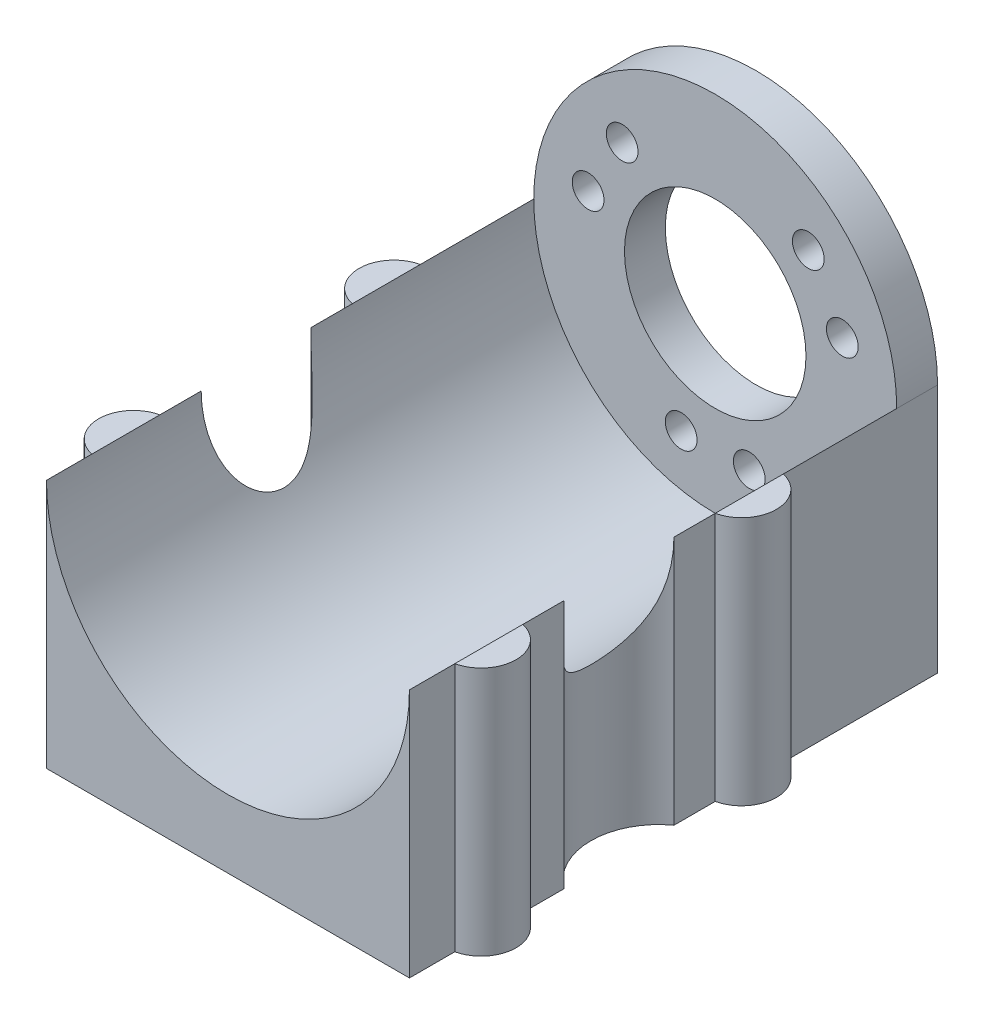
ISO-10303-21;
HEADER;
FILE_DESCRIPTION(('STEP AP214'),'2;1');
FILE_NAME('part.step','',(''),(''),'','','');
FILE_SCHEMA(('AUTOMOTIVE_DESIGN { 1 0 10303 214 1 1 1 1 }'));
ENDSEC;
DATA;
#1=APPLICATION_CONTEXT('core data for automotive mechanical design processes');
#2=APPLICATION_PROTOCOL_DEFINITION('international standard','automotive_design',2000,#1);
#3=PRODUCT_CONTEXT('',#1,'mechanical');
#4=PRODUCT('Part','Part','',(#3));
#5=PRODUCT_RELATED_PRODUCT_CATEGORY('part','',(#4));
#6=PRODUCT_DEFINITION_FORMATION('','',#4);
#7=PRODUCT_DEFINITION_CONTEXT('part definition',#1,'design');
#8=PRODUCT_DEFINITION('design','',#6,#7);
#9=PRODUCT_DEFINITION_SHAPE('','',#8);
#10=(LENGTH_UNIT() NAMED_UNIT(*) SI_UNIT(.MILLI.,.METRE.));
#11=(NAMED_UNIT(*) PLANE_ANGLE_UNIT() SI_UNIT($,.RADIAN.));
#12=(NAMED_UNIT(*) SI_UNIT($,.STERADIAN.) SOLID_ANGLE_UNIT());
#13=UNCERTAINTY_MEASURE_WITH_UNIT(LENGTH_MEASURE(1.E-05),#10,'distance_accuracy_value','');
#14=(GEOMETRIC_REPRESENTATION_CONTEXT(3) GLOBAL_UNCERTAINTY_ASSIGNED_CONTEXT((#13)) GLOBAL_UNIT_ASSIGNED_CONTEXT((#10,
#11,#12)) REPRESENTATION_CONTEXT('',''));
#15=CARTESIAN_POINT('',(0.,0.,0.));
#16=DIRECTION('',(0.,0.,1.));
#17=DIRECTION('',(1.,0.,0.));
#18=AXIS2_PLACEMENT_3D('',#15,#16,#17);
#19=CARTESIAN_POINT('',(0.,27.5,0.));
#20=DIRECTION('',(0.,-1.,0.));
#21=DIRECTION('',(0.,0.,-1.));
#22=AXIS2_PLACEMENT_3D('',#19,#20,#21);
#23=PLANE('',#22);
#24=CARTESIAN_POINT('',(0.84375067405984,27.5,-8.75));
#25=DIRECTION('',(0.,1.,0.));
#26=DIRECTION('',(0.,0.,-1.));
#27=AXIS2_PLACEMENT_3D('',#24,#25,#26);
#28=CIRCLE('',#27,3.84375014796441);
#29=CARTESIAN_POINT('',(0.,27.5,-12.5));
#30=VERTEX_POINT('',#29);
#31=CARTESIAN_POINT('',(0.,27.5,-5.));
#32=VERTEX_POINT('',#31);
#33=EDGE_CURVE('E286',#30,#32,#28,.T.);
#34=ORIENTED_EDGE('',*,*,#33,.T.);
#35=DIRECTION('',(0.,0.,-1.));
#36=VECTOR('',#35,1.);
#37=CARTESIAN_POINT('',(0.,27.5,0.));
#38=LINE('',#37,#36);
#39=EDGE_CURVE('E194',#32,#30,#38,.T.);
#40=ORIENTED_EDGE('',*,*,#39,.T.);
#41=EDGE_LOOP('',(#34,#40));
#42=FACE_BOUND('',#41,.T.);
#43=ADVANCED_FACE('F32',(#42),#23,.F.);
#44=CARTESIAN_POINT('',(0.843750674059841,27.5,-37.45));
#45=DIRECTION('',(0.,1.,0.));
#46=DIRECTION('',(0.,0.,-1.));
#47=AXIS2_PLACEMENT_3D('',#44,#45,#46);
#48=CIRCLE('',#47,3.84375014796441);
#49=CARTESIAN_POINT('',(0.,27.5,-41.2));
#50=VERTEX_POINT('',#49);
#51=CARTESIAN_POINT('',(0.,27.5,-33.7));
#52=VERTEX_POINT('',#51);
#53=EDGE_CURVE('E350',#50,#52,#48,.T.);
#54=ORIENTED_EDGE('',*,*,#53,.T.);
#55=EDGE_CURVE('E196',#52,#50,#38,.T.);
#56=ORIENTED_EDGE('',*,*,#55,.T.);
#57=EDGE_LOOP('',(#54,#56));
#58=FACE_BOUND('',#57,.T.);
#59=ADVANCED_FACE('F230',(#58),#23,.F.);
#60=CARTESIAN_POINT('',(39.1562493259402,27.5,-37.45));
#61=DIRECTION('',(0.,1.,0.));
#62=DIRECTION('',(0.,0.,1.));
#63=AXIS2_PLACEMENT_3D('',#60,#61,#62);
#64=CIRCLE('',#63,3.84375014796441);
#65=CARTESIAN_POINT('',(40.,27.5,-33.7));
#66=VERTEX_POINT('',#65);
#67=CARTESIAN_POINT('',(40.,27.5,-41.2));
#68=VERTEX_POINT('',#67);
#69=EDGE_CURVE('E268',#66,#68,#64,.T.);
#70=ORIENTED_EDGE('',*,*,#69,.T.);
#71=DIRECTION('',(0.,0.,-1.));
#72=VECTOR('',#71,1.);
#73=CARTESIAN_POINT('',(40.,27.5,0.));
#74=LINE('',#73,#72);
#75=EDGE_CURVE('E208',#68,#66,#74,.F.);
#76=ORIENTED_EDGE('',*,*,#75,.T.);
#77=EDGE_LOOP('',(#70,#76));
#78=FACE_BOUND('',#77,.T.);
#79=ADVANCED_FACE('F237',(#78),#23,.F.);
#80=CARTESIAN_POINT('',(40.,27.5,-53.7));
#81=DIRECTION('',(-1.,0.,0.));
#82=DIRECTION('',(0.,0.,1.));
#83=AXIS2_PLACEMENT_3D('',#80,#81,#82);
#84=PLANE('',#83);
#85=DIRECTION('',(0.,0.,-1.));
#86=VECTOR('',#85,1.);
#87=CARTESIAN_POINT('',(40.,0.,-53.7));
#88=LINE('',#87,#86);
#89=CARTESIAN_POINT('',(40.,0.,-12.5));
#90=VERTEX_POINT('',#89);
#91=CARTESIAN_POINT('',(40.,0.,-17.05));
#92=VERTEX_POINT('',#91);
#93=EDGE_CURVE('E315',#90,#92,#88,.T.);
#94=ORIENTED_EDGE('',*,*,#93,.T.);
#95=DIRECTION('',(0.,1.,0.));
#96=VECTOR('',#95,1.);
#97=CARTESIAN_POINT('',(40.,0.,-17.05));
#98=LINE('',#97,#96);
#99=CARTESIAN_POINT('',(40.,27.5,-17.05));
#100=VERTEX_POINT('',#99);
#101=EDGE_CURVE('E53',#92,#100,#98,.T.);
#102=ORIENTED_EDGE('',*,*,#101,.T.);
#103=DIRECTION('',(0.,0.,-1.));
#104=VECTOR('',#103,1.);
#105=CARTESIAN_POINT('',(40.,27.5,-53.7));
#106=LINE('',#105,#104);
#107=CARTESIAN_POINT('',(40.,27.5,-12.5));
#108=VERTEX_POINT('',#107);
#109=EDGE_CURVE('E302',#108,#100,#106,.T.);
#110=ORIENTED_EDGE('',*,*,#109,.F.);
#111=DIRECTION('',(0.,1.,0.));
#112=VECTOR('',#111,1.);
#113=CARTESIAN_POINT('',(40.,0.,-12.5));
#114=LINE('',#113,#112);
#115=EDGE_CURVE('E340',#90,#108,#114,.T.);
#116=ORIENTED_EDGE('',*,*,#115,.F.);
#117=EDGE_LOOP('',(#94,#102,#110,#116));
#118=FACE_BOUND('',#117,.T.);
#119=ADVANCED_FACE('F258',(#118),#84,.F.);
#120=CARTESIAN_POINT('',(0.,27.5,0.));
#121=DIRECTION('',(1.,0.,0.));
#122=DIRECTION('',(0.,0.,-1.));
#123=AXIS2_PLACEMENT_3D('',#120,#121,#122);
#124=PLANE('',#123);
#125=DIRECTION('',(0.,0.,1.));
#126=VECTOR('',#125,1.);
#127=CARTESIAN_POINT('',(0.,0.,0.));
#128=LINE('',#127,#126);
#129=CARTESIAN_POINT('',(0.,0.,-33.7));
#130=VERTEX_POINT('',#129);
#131=CARTESIAN_POINT('',(0.,0.,-29.15));
#132=VERTEX_POINT('',#131);
#133=EDGE_CURVE('E319',#130,#132,#128,.T.);
#134=ORIENTED_EDGE('',*,*,#133,.T.);
#135=DIRECTION('',(0.,1.,0.));
#136=VECTOR('',#135,1.);
#137=CARTESIAN_POINT('',(0.,0.,-29.15));
#138=LINE('',#137,#136);
#139=CARTESIAN_POINT('',(0.,27.5,-29.15));
#140=VERTEX_POINT('',#139);
#141=EDGE_CURVE('E60',#132,#140,#138,.T.);
#142=ORIENTED_EDGE('',*,*,#141,.T.);
#143=DIRECTION('',(0.,0.,1.));
#144=VECTOR('',#143,1.);
#145=CARTESIAN_POINT('',(0.,27.5,0.));
#146=LINE('',#145,#144);
#147=EDGE_CURVE('E308',#52,#140,#146,.T.);
#148=ORIENTED_EDGE('',*,*,#147,.F.);
#149=DIRECTION('',(0.,1.,0.));
#150=VECTOR('',#149,1.);
#151=CARTESIAN_POINT('',(0.,0.,-33.7));
#152=LINE('',#151,#150);
#153=EDGE_CURVE('E280',#130,#52,#152,.T.);
#154=ORIENTED_EDGE('',*,*,#153,.F.);
#155=EDGE_LOOP('',(#134,#142,#148,#154));
#156=FACE_BOUND('',#155,.T.);
#157=ADVANCED_FACE('F254',(#156),#124,.F.);
#158=CARTESIAN_POINT('',(40.,0.,0.));
#159=VERTEX_POINT('',#158);
#160=CARTESIAN_POINT('',(40.,0.,-5.00000000000001));
#161=VERTEX_POINT('',#160);
#162=EDGE_CURVE('E312',#159,#161,#88,.T.);
#163=ORIENTED_EDGE('',*,*,#162,.T.);
#164=DIRECTION('',(0.,1.,0.));
#165=VECTOR('',#164,1.);
#166=CARTESIAN_POINT('',(40.,0.,-5.));
#167=LINE('',#166,#165);
#168=CARTESIAN_POINT('',(40.,27.5,-5.));
#169=VERTEX_POINT('',#168);
#170=EDGE_CURVE('E343',#161,#169,#167,.T.);
#171=ORIENTED_EDGE('',*,*,#170,.T.);
#172=CARTESIAN_POINT('',(40.,27.5,0.));
#173=VERTEX_POINT('',#172);
#174=EDGE_CURVE('E299',#173,#169,#106,.T.);
#175=ORIENTED_EDGE('',*,*,#174,.F.);
#176=DIRECTION('',(0.,-1.,0.));
#177=VECTOR('',#176,1.);
#178=CARTESIAN_POINT('',(40.,27.5,0.));
#179=LINE('',#178,#177);
#180=EDGE_CURVE('E46',#173,#159,#179,.T.);
#181=ORIENTED_EDGE('',*,*,#180,.T.);
#182=EDGE_LOOP('',(#163,#171,#175,#181));
#183=FACE_BOUND('',#182,.T.);
#184=ADVANCED_FACE('F264',(#183),#84,.F.);
#185=CARTESIAN_POINT('',(0.,0.,-58.2));
#186=VERTEX_POINT('',#185);
#187=CARTESIAN_POINT('',(0.,0.,-41.2));
#188=VERTEX_POINT('',#187);
#189=EDGE_CURVE('E317',#186,#188,#128,.T.);
#190=ORIENTED_EDGE('',*,*,#189,.T.);
#191=DIRECTION('',(0.,1.,0.));
#192=VECTOR('',#191,1.);
#193=CARTESIAN_POINT('',(0.,0.,-41.2));
#194=LINE('',#193,#192);
#195=EDGE_CURVE('E274',#188,#50,#194,.T.);
#196=ORIENTED_EDGE('',*,*,#195,.T.);
#197=CARTESIAN_POINT('',(0.,27.5,-53.7));
#198=VERTEX_POINT('',#197);
#199=EDGE_CURVE('E305',#198,#50,#146,.T.);
#200=ORIENTED_EDGE('',*,*,#199,.F.);
#201=DIRECTION('',(0.,0.,1.));
#202=VECTOR('',#201,1.);
#203=CARTESIAN_POINT('',(0.,27.5,-58.2));
#204=LINE('',#203,#202);
#205=CARTESIAN_POINT('',(0.,27.5,-58.2));
#206=VERTEX_POINT('',#205);
#207=EDGE_CURVE('E185',#206,#198,#204,.T.);
#208=ORIENTED_EDGE('',*,*,#207,.F.);
#209=DIRECTION('',(0.,1.,0.));
#210=VECTOR('',#209,1.);
#211=CARTESIAN_POINT('',(0.,0.,-58.2));
#212=LINE('',#211,#210);
#213=EDGE_CURVE('E176',#186,#206,#212,.T.);
#214=ORIENTED_EDGE('',*,*,#213,.F.);
#215=EDGE_LOOP('',(#190,#196,#200,#208,#214));
#216=FACE_BOUND('',#215,.T.);
#217=ADVANCED_FACE('F368',(#216),#124,.F.);
#218=CARTESIAN_POINT('',(40.,27.5,-29.15));
#219=VERTEX_POINT('',#218);
#220=EDGE_CURVE('E303',#219,#66,#106,.T.);
#221=ORIENTED_EDGE('',*,*,#220,.F.);
#222=DIRECTION('',(0.,1.,0.));
#223=VECTOR('',#222,1.);
#224=CARTESIAN_POINT('',(40.,0.,-29.15));
#225=LINE('',#224,#223);
#226=CARTESIAN_POINT('',(40.,0.,-29.15));
#227=VERTEX_POINT('',#226);
#228=EDGE_CURVE('E381',#227,#219,#225,.T.);
#229=ORIENTED_EDGE('',*,*,#228,.F.);
#230=CARTESIAN_POINT('',(40.,0.,-33.7));
#231=VERTEX_POINT('',#230);
#232=EDGE_CURVE('E316',#227,#231,#88,.T.);
#233=ORIENTED_EDGE('',*,*,#232,.T.);
#234=DIRECTION('',(0.,1.,0.));
#235=VECTOR('',#234,1.);
#236=CARTESIAN_POINT('',(40.,0.,-33.7));
#237=LINE('',#236,#235);
#238=EDGE_CURVE('E284',#231,#66,#237,.T.);
#239=ORIENTED_EDGE('',*,*,#238,.T.);
#240=EDGE_LOOP('',(#221,#229,#233,#239));
#241=FACE_BOUND('',#240,.T.);
#242=ADVANCED_FACE('F388',(#241),#84,.F.);
#243=CARTESIAN_POINT('',(0.,27.5,-17.05));
#244=VERTEX_POINT('',#243);
#245=EDGE_CURVE('E309',#244,#30,#146,.T.);
#246=ORIENTED_EDGE('',*,*,#245,.F.);
#247=DIRECTION('',(0.,1.,0.));
#248=VECTOR('',#247,1.);
#249=CARTESIAN_POINT('',(0.,0.,-17.05));
#250=LINE('',#249,#248);
#251=CARTESIAN_POINT('',(0.,0.,-17.05));
#252=VERTEX_POINT('',#251);
#253=EDGE_CURVE('E345',#252,#244,#250,.T.);
#254=ORIENTED_EDGE('',*,*,#253,.F.);
#255=CARTESIAN_POINT('',(0.,0.,-12.5));
#256=VERTEX_POINT('',#255);
#257=EDGE_CURVE('E320',#252,#256,#128,.T.);
#258=ORIENTED_EDGE('',*,*,#257,.T.);
#259=DIRECTION('',(0.,1.,0.));
#260=VECTOR('',#259,1.);
#261=CARTESIAN_POINT('',(0.,0.,-12.5));
#262=LINE('',#261,#260);
#263=EDGE_CURVE('E293',#256,#30,#262,.T.);
#264=ORIENTED_EDGE('',*,*,#263,.T.);
#265=EDGE_LOOP('',(#246,#254,#258,#264));
#266=FACE_BOUND('',#265,.T.);
#267=ADVANCED_FACE('F255',(#266),#124,.F.);
#268=CARTESIAN_POINT('',(40.,27.5,0.));
#269=DIRECTION('',(0.,0.,-1.));
#270=DIRECTION('',(-1.,0.,0.));
#271=AXIS2_PLACEMENT_3D('',#268,#269,#270);
#272=PLANE('',#271);
#273=ORIENTED_EDGE('',*,*,#180,.F.);
#274=CARTESIAN_POINT('',(20.,27.5,0.));
#275=DIRECTION('',(0.,0.,-1.));
#276=DIRECTION('',(-1.,0.,0.));
#277=AXIS2_PLACEMENT_3D('',#274,#275,#276);
#278=CIRCLE('',#277,20.);
#279=CARTESIAN_POINT('',(0.,27.5,0.));
#280=VERTEX_POINT('',#279);
#281=EDGE_CURVE('E188',#173,#280,#278,.T.);
#282=ORIENTED_EDGE('',*,*,#281,.T.);
#283=DIRECTION('',(0.,-1.,0.));
#284=VECTOR('',#283,1.);
#285=CARTESIAN_POINT('',(0.,27.5,0.));
#286=LINE('',#285,#284);
#287=CARTESIAN_POINT('',(0.,0.,0.));
#288=VERTEX_POINT('',#287);
#289=EDGE_CURVE('E307',#280,#288,#286,.T.);
#290=ORIENTED_EDGE('',*,*,#289,.T.);
#291=DIRECTION('',(1.,0.,0.));
#292=VECTOR('',#291,1.);
#293=CARTESIAN_POINT('',(40.,0.,0.));
#294=LINE('',#293,#292);
#295=EDGE_CURVE('E296',#288,#159,#294,.T.);
#296=ORIENTED_EDGE('',*,*,#295,.T.);
#297=EDGE_LOOP('',(#273,#282,#290,#296));
#298=FACE_BOUND('',#297,.T.);
#299=ADVANCED_FACE('F34',(#298),#272,.F.);
#300=CARTESIAN_POINT('',(40.,27.5,-53.7));
#301=VERTEX_POINT('',#300);
#302=EDGE_CURVE('E304',#68,#301,#106,.T.);
#303=ORIENTED_EDGE('',*,*,#302,.F.);
#304=DIRECTION('',(0.,1.,0.));
#305=VECTOR('',#304,1.);
#306=CARTESIAN_POINT('',(40.,0.,-41.2));
#307=LINE('',#306,#305);
#308=CARTESIAN_POINT('',(40.,0.,-41.2));
#309=VERTEX_POINT('',#308);
#310=EDGE_CURVE('E277',#309,#68,#307,.T.);
#311=ORIENTED_EDGE('',*,*,#310,.F.);
#312=CARTESIAN_POINT('',(40.,0.,-58.2));
#313=VERTEX_POINT('',#312);
#314=EDGE_CURVE('E166',#309,#313,#88,.T.);
#315=ORIENTED_EDGE('',*,*,#314,.T.);
#316=DIRECTION('',(0.,-1.,0.));
#317=VECTOR('',#316,1.);
#318=CARTESIAN_POINT('',(40.,27.5,-58.2));
#319=LINE('',#318,#317);
#320=CARTESIAN_POINT('',(40.,27.5,-58.2));
#321=VERTEX_POINT('',#320);
#322=EDGE_CURVE('E158',#321,#313,#319,.T.);
#323=ORIENTED_EDGE('',*,*,#322,.F.);
#324=DIRECTION('',(0.,0.,1.));
#325=VECTOR('',#324,1.);
#326=CARTESIAN_POINT('',(40.,27.5,-58.2));
#327=LINE('',#326,#325);
#328=EDGE_CURVE('E163',#321,#301,#327,.T.);
#329=ORIENTED_EDGE('',*,*,#328,.T.);
#330=EDGE_LOOP('',(#303,#311,#315,#323,#329));
#331=FACE_BOUND('',#330,.T.);
#332=ADVANCED_FACE('F161',(#331),#84,.F.);
#333=EDGE_CURVE('E301',#32,#280,#146,.T.);
#334=ORIENTED_EDGE('',*,*,#333,.F.);
#335=DIRECTION('',(0.,1.,0.));
#336=VECTOR('',#335,1.);
#337=CARTESIAN_POINT('',(0.,0.,-5.));
#338=LINE('',#337,#336);
#339=CARTESIAN_POINT('',(0.,0.,-5.));
#340=VERTEX_POINT('',#339);
#341=EDGE_CURVE('E291',#340,#32,#338,.T.);
#342=ORIENTED_EDGE('',*,*,#341,.F.);
#343=EDGE_CURVE('E314',#340,#288,#128,.T.);
#344=ORIENTED_EDGE('',*,*,#343,.T.);
#345=ORIENTED_EDGE('',*,*,#289,.F.);
#346=EDGE_LOOP('',(#334,#342,#344,#345));
#347=FACE_BOUND('',#346,.T.);
#348=ADVANCED_FACE('F244',(#347),#124,.F.);
#349=CARTESIAN_POINT('',(39.1562493259402,27.5,-8.75));
#350=DIRECTION('',(0.,1.,0.));
#351=DIRECTION('',(0.,0.,1.));
#352=AXIS2_PLACEMENT_3D('',#349,#350,#351);
#353=CIRCLE('',#352,3.84375014796441);
#354=EDGE_CURVE('E341',#169,#108,#353,.T.);
#355=ORIENTED_EDGE('',*,*,#354,.T.);
#356=EDGE_CURVE('E200',#108,#169,#74,.F.);
#357=ORIENTED_EDGE('',*,*,#356,.T.);
#358=EDGE_LOOP('',(#355,#357));
#359=FACE_BOUND('',#358,.T.);
#360=ADVANCED_FACE('F233',(#359),#23,.F.);
#361=CARTESIAN_POINT('',(0.,0.,0.));
#362=DIRECTION('',(0.,-1.,0.));
#363=DIRECTION('',(0.,0.,-1.));
#364=AXIS2_PLACEMENT_3D('',#361,#362,#363);
#365=PLANE('',#364);
#366=CARTESIAN_POINT('',(-4.35362575000476,0.,-23.1));
#367=DIRECTION('',(0.,1.,0.));
#368=DIRECTION('',(0.,0.,1.));
#369=AXIS2_PLACEMENT_3D('',#366,#367,#368);
#370=CIRCLE('',#369,7.4536271151101);
#371=EDGE_CURVE('E370',#252,#132,#370,.T.);
#372=ORIENTED_EDGE('',*,*,#371,.T.);
#373=ORIENTED_EDGE('',*,*,#133,.F.);
#374=CARTESIAN_POINT('',(0.843750674059841,0.,-37.45));
#375=DIRECTION('',(0.,1.,0.));
#376=DIRECTION('',(0.,0.,-1.));
#377=AXIS2_PLACEMENT_3D('',#374,#375,#376);
#378=CIRCLE('',#377,3.84375014796441);
#379=EDGE_CURVE('E352',#188,#130,#378,.T.);
#380=ORIENTED_EDGE('',*,*,#379,.F.);
#381=ORIENTED_EDGE('',*,*,#189,.F.);
#382=DIRECTION('',(-1.,0.,0.));
#383=VECTOR('',#382,1.);
#384=CARTESIAN_POINT('',(40.,0.,-58.2));
#385=LINE('',#384,#383);
#386=EDGE_CURVE('E170',#313,#186,#385,.T.);
#387=ORIENTED_EDGE('',*,*,#386,.F.);
#388=ORIENTED_EDGE('',*,*,#314,.F.);
#389=CARTESIAN_POINT('',(39.1562493259402,0.,-37.45));
#390=DIRECTION('',(0.,1.,0.));
#391=DIRECTION('',(0.,0.,1.));
#392=AXIS2_PLACEMENT_3D('',#389,#390,#391);
#393=CIRCLE('',#392,3.84375014796441);
#394=EDGE_CURVE('E273',#231,#309,#393,.T.);
#395=ORIENTED_EDGE('',*,*,#394,.F.);
#396=ORIENTED_EDGE('',*,*,#232,.F.);
#397=CARTESIAN_POINT('',(44.3536257500048,0.,-23.1));
#398=DIRECTION('',(0.,1.,0.));
#399=DIRECTION('',(0.,0.,-1.));
#400=AXIS2_PLACEMENT_3D('',#397,#398,#399);
#401=CIRCLE('',#400,7.4536271151101);
#402=EDGE_CURVE('E199',#227,#92,#401,.T.);
#403=ORIENTED_EDGE('',*,*,#402,.T.);
#404=ORIENTED_EDGE('',*,*,#93,.F.);
#405=CARTESIAN_POINT('',(39.1562493259402,0.,-8.75));
#406=DIRECTION('',(0.,1.,0.));
#407=DIRECTION('',(0.,0.,1.));
#408=AXIS2_PLACEMENT_3D('',#405,#406,#407);
#409=CIRCLE('',#408,3.84375014796441);
#410=EDGE_CURVE('E335',#161,#90,#409,.T.);
#411=ORIENTED_EDGE('',*,*,#410,.F.);
#412=ORIENTED_EDGE('',*,*,#162,.F.);
#413=ORIENTED_EDGE('',*,*,#295,.F.);
#414=ORIENTED_EDGE('',*,*,#343,.F.);
#415=CARTESIAN_POINT('',(0.84375067405984,0.,-8.75));
#416=DIRECTION('',(0.,1.,0.));
#417=DIRECTION('',(0.,0.,-1.));
#418=AXIS2_PLACEMENT_3D('',#415,#416,#417);
#419=CIRCLE('',#418,3.84375014796441);
#420=EDGE_CURVE('E288',#256,#340,#419,.T.);
#421=ORIENTED_EDGE('',*,*,#420,.F.);
#422=ORIENTED_EDGE('',*,*,#257,.F.);
#423=EDGE_LOOP('',(#372,#373,#380,#381,#387,#388,#395,#396,#403,#404,#411,#412,#413,#414,#421,#422));
#424=FACE_BOUND('',#423,.T.);
#425=ADVANCED_FACE('F243',(#424),#365,.T.);
#426=CARTESIAN_POINT('',(0.84375067405984,0.,-8.75));
#427=DIRECTION('',(0.,1.,0.));
#428=DIRECTION('',(0.,0.,1.));
#429=AXIS2_PLACEMENT_3D('',#426,#427,#428);
#430=CYLINDRICAL_SURFACE('',#429,3.84375014796441);
#431=ORIENTED_EDGE('',*,*,#33,.F.);
#432=ORIENTED_EDGE('',*,*,#263,.F.);
#433=ORIENTED_EDGE('',*,*,#420,.T.);
#434=ORIENTED_EDGE('',*,*,#341,.T.);
#435=EDGE_LOOP('',(#431,#432,#433,#434));
#436=FACE_BOUND('',#435,.T.);
#437=ADVANCED_FACE('F250',(#436),#430,.T.);
#438=CARTESIAN_POINT('',(39.1562493259402,0.,-37.45));
#439=DIRECTION('',(0.,1.,0.));
#440=DIRECTION('',(0.,0.,1.));
#441=AXIS2_PLACEMENT_3D('',#438,#439,#440);
#442=CYLINDRICAL_SURFACE('',#441,3.84375014796441);
#443=ORIENTED_EDGE('',*,*,#69,.F.);
#444=ORIENTED_EDGE('',*,*,#238,.F.);
#445=ORIENTED_EDGE('',*,*,#394,.T.);
#446=ORIENTED_EDGE('',*,*,#310,.T.);
#447=EDGE_LOOP('',(#443,#444,#445,#446));
#448=FACE_BOUND('',#447,.T.);
#449=ADVANCED_FACE('F390',(#448),#442,.T.);
#450=CARTESIAN_POINT('',(0.843750674059841,0.,-37.45));
#451=DIRECTION('',(0.,1.,0.));
#452=DIRECTION('',(0.,0.,1.));
#453=AXIS2_PLACEMENT_3D('',#450,#451,#452);
#454=CYLINDRICAL_SURFACE('',#453,3.84375014796441);
#455=ORIENTED_EDGE('',*,*,#53,.F.);
#456=ORIENTED_EDGE('',*,*,#195,.F.);
#457=ORIENTED_EDGE('',*,*,#379,.T.);
#458=ORIENTED_EDGE('',*,*,#153,.T.);
#459=EDGE_LOOP('',(#455,#456,#457,#458));
#460=FACE_BOUND('',#459,.T.);
#461=ADVANCED_FACE('F360',(#460),#454,.T.);
#462=CARTESIAN_POINT('',(39.1562493259402,0.,-8.75));
#463=DIRECTION('',(0.,1.,0.));
#464=DIRECTION('',(0.,0.,1.));
#465=AXIS2_PLACEMENT_3D('',#462,#463,#464);
#466=CYLINDRICAL_SURFACE('',#465,3.84375014796441);
#467=ORIENTED_EDGE('',*,*,#354,.F.);
#468=ORIENTED_EDGE('',*,*,#170,.F.);
#469=ORIENTED_EDGE('',*,*,#410,.T.);
#470=ORIENTED_EDGE('',*,*,#115,.T.);
#471=EDGE_LOOP('',(#467,#468,#469,#470));
#472=FACE_BOUND('',#471,.T.);
#473=ADVANCED_FACE('F227',(#472),#466,.T.);
#474=CARTESIAN_POINT('',(44.3536257500048,0.,-23.1));
#475=DIRECTION('',(0.,1.,0.));
#476=DIRECTION('',(0.,0.,1.));
#477=AXIS2_PLACEMENT_3D('',#474,#475,#476);
#478=CYLINDRICAL_SURFACE('',#477,7.4536271151101);
#479=ORIENTED_EDGE('',*,*,#228,.T.);
#480=CARTESIAN_POINT('',(40.,27.5,-29.15));
#481=CARTESIAN_POINT('',(40.0000044320142,27.2809861741363,-29.1499819755803));
#482=CARTESIAN_POINT('',(39.9964026215211,27.0619698927966,-29.1474104836616));
#483=CARTESIAN_POINT('',(39.9820173738236,26.6242817792757,-29.1370311363031));
#484=CARTESIAN_POINT('',(39.9712334058151,26.4056099737505,-29.129222893836));
#485=CARTESIAN_POINT('',(39.9424853935441,25.9685469516378,-29.1082191623109));
#486=CARTESIAN_POINT('',(39.9245067351942,25.7501572193849,-29.0950127070513));
#487=CARTESIAN_POINT('',(39.8814359336612,25.3144993084312,-29.0629524115657));
#488=CARTESIAN_POINT('',(39.8563439472596,25.0972311051187,-29.0440986958078));
#489=CARTESIAN_POINT('',(39.798819502016,24.6617749167229,-29.000137487721));
#490=CARTESIAN_POINT('',(39.7663072291133,24.4436043227704,-28.9749616743034));
#491=CARTESIAN_POINT('',(39.6942497264395,24.0093013020316,-28.9179793024549));
#492=CARTESIAN_POINT('',(39.6547046889251,23.793168819699,-28.8861729252816));
#493=CARTESIAN_POINT('',(39.5688163778803,23.3636561107217,-28.8153524411179));
#494=CARTESIAN_POINT('',(39.5224794420684,23.1502735178588,-28.7763450448988));
#495=CARTESIAN_POINT('',(39.423253475407,22.7266849103043,-28.6903751365772));
#496=CARTESIAN_POINT('',(39.3703653954397,22.5164784395644,-28.6434137786098));
#497=CARTESIAN_POINT('',(39.251227901106,22.0732724997272,-28.5341007166382));
#498=CARTESIAN_POINT('',(39.1841347143618,21.8407920764826,-28.4705492787559));
#499=CARTESIAN_POINT('',(39.042747934083,21.3818804259715,-28.330775988508));
#500=CARTESIAN_POINT('',(38.9684543834363,21.1554491626844,-28.2545542116092));
#501=CARTESIAN_POINT('',(38.8138739616965,20.7107903163371,-28.0880432294459));
#502=CARTESIAN_POINT('',(38.7336068559832,20.4925389820738,-27.9977994288594));
#503=CARTESIAN_POINT('',(38.568190635671,20.0653038409057,-27.8012550841895));
#504=CARTESIAN_POINT('',(38.4830428871788,19.8563174694744,-27.6949590196983));
#505=CARTESIAN_POINT('',(38.3319761646018,19.5021489319267,-27.4940581083091));
#506=CARTESIAN_POINT('',(38.266746581595,19.3543853399455,-27.4034820742783));
#507=CARTESIAN_POINT('',(38.1355519134199,19.06633046894,-27.2116447950261));
#508=CARTESIAN_POINT('',(38.0695870278126,18.9260372194359,-27.1103863887528));
#509=CARTESIAN_POINT('',(37.9381284088467,18.654306381118,-26.8965344193414));
#510=CARTESIAN_POINT('',(37.8726342965287,18.5228607310799,-26.7839514141589));
#511=CARTESIAN_POINT('',(37.7435123795516,18.270269798125,-26.5469113077276));
#512=CARTESIAN_POINT('',(37.6798840131236,18.1491213934472,-26.422457829643));
#513=CARTESIAN_POINT('',(37.5256473740208,17.8620774279556,-26.0969360231209));
#514=CARTESIAN_POINT('',(37.4371269247059,17.7034079066278,-25.8882472225998));
#515=CARTESIAN_POINT('',(37.3150955103507,17.4902914635027,-25.5555348956875));
#516=CARTESIAN_POINT('',(37.2761963081812,17.4233785162386,-25.4413005522429));
#517=CARTESIAN_POINT('',(37.2028397009642,17.2986512720065,-25.2066329739777));
#518=CARTESIAN_POINT('',(37.1683800158102,17.2408323010355,-25.0862029660428));
#519=CARTESIAN_POINT('',(37.104424222826,17.1345491499124,-24.8384396577384));
#520=CARTESIAN_POINT('',(37.0749831038914,17.0861878451556,-24.7110478677668));
#521=CARTESIAN_POINT('',(37.0223459629332,17.0003679019247,-24.4514502662681));
#522=CARTESIAN_POINT('',(36.9991466377729,16.9629034959933,-24.3192470431558));
#523=CARTESIAN_POINT('',(36.9596956427652,16.8995225902325,-24.0511571098055));
#524=CARTESIAN_POINT('',(36.943440022869,16.873599524553,-23.9152725406804));
#525=CARTESIAN_POINT('',(36.9183903009713,16.8337621435832,-23.6410824241469));
#526=CARTESIAN_POINT('',(36.9095948878718,16.8198457181723,-23.5027773065016));
#527=CARTESIAN_POINT('',(36.9004916564085,16.8054483713632,-23.2459773145458));
#528=CARTESIAN_POINT('',(36.8991115933543,16.80326999018,-23.1276117015717));
#529=CARTESIAN_POINT('',(36.9019882878442,16.8078158992745,-22.891080269005));
#530=CARTESIAN_POINT('',(36.906246770031,16.8145429134149,-22.7729145216153));
#531=CARTESIAN_POINT('',(36.9202981065982,16.8368069721399,-22.5378166296684));
#532=CARTESIAN_POINT('',(36.9300877150631,16.8523388496494,-22.4208838025383));
#533=CARTESIAN_POINT('',(36.9549547995047,16.8919820554752,-22.1890377400185));
#534=CARTESIAN_POINT('',(36.9700343218127,16.9160967039727,-22.0741253042803));
#535=CARTESIAN_POINT('',(37.0211987078957,16.9984329089835,-21.743468204926));
#536=CARTESIAN_POINT('',(37.063896368387,17.0677000574869,-21.5313719297556));
#537=CARTESIAN_POINT('',(37.16412280261,17.2334423983178,-21.1220719969498));
#538=CARTESIAN_POINT('',(37.221656544508,17.3299267058883,-20.92487335675));
#539=CARTESIAN_POINT('',(37.3715562888512,17.5874499393864,-20.4766151068404));
#540=CARTESIAN_POINT('',(37.4688748403036,17.7591108187507,-20.2332997197073));
#541=CARTESIAN_POINT('',(37.6748042025237,18.1379620999537,-19.7815784392806));
#542=CARTESIAN_POINT('',(37.7834357993867,18.3452183732715,-19.5732387099863));
#543=CARTESIAN_POINT('',(37.9723927299369,18.7236482370869,-19.2449665078094));
#544=CARTESIAN_POINT('',(38.0519394842542,18.8882166814191,-19.1167805084224));
#545=CARTESIAN_POINT('',(38.2105411217215,19.2288777549985,-18.876276936976));
#546=CARTESIAN_POINT('',(38.2895957777517,19.4049753276368,-18.7639662379006));
#547=CARTESIAN_POINT('',(38.4455155901746,19.7668348541228,-18.5537992802398));
#548=CARTESIAN_POINT('',(38.522377420788,19.9526103935062,-18.4559641237827));
#549=CARTESIAN_POINT('',(38.6724716178933,20.3319825437083,-18.2735122242775));
#550=CARTESIAN_POINT('',(38.745702792429,20.5255816856713,-18.1888998029315));
#551=CARTESIAN_POINT('',(38.9263367247288,21.0270968992968,-17.9884375165129));
#552=CARTESIAN_POINT('',(39.0304740667646,21.3395204154479,-17.880878752291));
#553=CARTESIAN_POINT('',(39.2248498062282,21.9758659577007,-17.689754497234));
#554=CARTESIAN_POINT('',(39.3150800317592,22.2997946077801,-17.6062030885207));
#555=CARTESIAN_POINT('',(39.4800540517821,22.9566140726652,-17.4593388198891));
#556=CARTESIAN_POINT('',(39.5547719742184,23.2895188300403,-17.3960596769507));
#557=CARTESIAN_POINT('',(39.6874369288518,23.9613495792537,-17.2870311310642));
#558=CARTESIAN_POINT('',(39.7453889721295,24.3002737397668,-17.2412764889674));
#559=CARTESIAN_POINT('',(39.8287737108389,24.8776319929761,-17.1768172050283));
#560=CARTESIAN_POINT('',(39.8587284326953,25.1149911930523,-17.1541203698048));
#561=CARTESIAN_POINT('',(39.9101399056472,25.5911630842265,-17.1156015470612));
#562=CARTESIAN_POINT('',(39.9315975869998,25.8299756133056,-17.0997788069461));
#563=CARTESIAN_POINT('',(39.9658160398021,26.3070908971607,-17.0747072715661));
#564=CARTESIAN_POINT('',(39.9786291354946,26.5453878549438,-17.0654189098897));
#565=CARTESIAN_POINT('',(39.9957243008201,27.022457351423,-17.0530778680965));
#566=CARTESIAN_POINT('',(40.0000060888888,27.2612299055553,-17.0500253937867));
#567=CARTESIAN_POINT('',(40.,27.5,-17.05));
#568=B_SPLINE_CURVE_WITH_KNOTS('',3,(#480,#481,#482,#483,#484,#485,#486,#487,#488,#489,#490,
#491,#492,#493,#494,#495,#496,#497,#498,#499,#500,#501,#502,#503,#504,#505,#506,#507,#508,#509,
#510,#511,#512,#513,#514,#515,#516,#517,#518,#519,#520,#521,#522,#523,#524,#525,#526,#527,#528,
#529,#530,#531,#532,#533,#534,#535,#536,#537,#538,#539,#540,#541,#542,#543,#544,#545,#546,#547,
#548,#549,#550,#551,#552,#553,#554,#555,#556,#557,#558,#559,#560,#561,#562,#563,#564,#565,#566,
#567),.UNSPECIFIED.,.F.,.F.,(4,2,2,2,2,2,2,2,2,2,2,2,2,2,2,2,2,2,2,2,2,2,2,2,2,2,2,2,2,2,2,2,2,
2,2,2,2,2,2,2,2,2,2,4),(0.,0.657000740933077,1.31405004352192,1.97244079572019,2.63081703775938,
3.29663980539444,3.96244437402361,4.62763157016099,5.29272232892066,6.04278421147891,
6.79284162669172,7.54051904105099,8.28798819059977,8.84313676109608,9.39813816515438,
9.95262685298091,10.5069468353541,11.3333655777837,11.7469108818085,12.1602429377274,
12.5778474801402,12.9952305909741,13.4123759488581,13.8294479801183,14.1841728007183,
14.5390061448587,14.893631472674,15.2483941340332,15.9267970267597,16.6054273923051,
17.5400599354773,18.4764410868081,19.1453347516759,19.8145171232946,20.4846656010597,
21.1550326532783,22.1927583585666,23.2310915312707,24.2711428078961,25.3108829062163,
26.0315960290876,26.7522302263729,27.4684624437151,28.1847182989439),.UNSPECIFIED.);
#569=EDGE_CURVE('E201',#219,#100,#568,.T.);
#570=ORIENTED_EDGE('',*,*,#569,.T.);
#571=ORIENTED_EDGE('',*,*,#101,.F.);
#572=ORIENTED_EDGE('',*,*,#402,.F.);
#573=EDGE_LOOP('',(#479,#570,#571,#572));
#574=FACE_BOUND('',#573,.T.);
#575=ADVANCED_FACE('F210',(#574),#478,.F.);
#576=CARTESIAN_POINT('',(-4.35362575000476,0.,-23.1));
#577=DIRECTION('',(0.,1.,0.));
#578=DIRECTION('',(0.,0.,1.));
#579=AXIS2_PLACEMENT_3D('',#576,#577,#578);
#580=CYLINDRICAL_SURFACE('',#579,7.4536271151101);
#581=ORIENTED_EDGE('',*,*,#253,.T.);
#582=CARTESIAN_POINT('',(0.,27.5,-17.05));
#583=CARTESIAN_POINT('',(-4.43201419589149E-06,27.2809861741363,-17.0500180244196));
#584=CARTESIAN_POINT('',(0.00359737847890934,27.0619698927966,-17.0525895163384));
#585=CARTESIAN_POINT('',(0.0179826261763674,26.6242817792757,-17.0629688636969));
#586=CARTESIAN_POINT('',(0.0287665941849251,26.4056099737505,-17.070777106164));
#587=CARTESIAN_POINT('',(0.057514606455884,25.9685469516378,-17.0917808376891));
#588=CARTESIAN_POINT('',(0.0754932648057919,25.7501572193849,-17.1049872929487));
#589=CARTESIAN_POINT('',(0.118564066338854,25.3144993084312,-17.1370475884343));
#590=CARTESIAN_POINT('',(0.143656052740422,25.0972311051187,-17.1559013041922));
#591=CARTESIAN_POINT('',(0.201180497984021,24.6617749167229,-17.199862512279));
#592=CARTESIAN_POINT('',(0.233692770886683,24.4436043227704,-17.2250383256966));
#593=CARTESIAN_POINT('',(0.305750273560543,24.0093013020316,-17.2820206975451));
#594=CARTESIAN_POINT('',(0.345295311074878,23.793168819699,-17.3138270747184));
#595=CARTESIAN_POINT('',(0.431183622119719,23.3636561107218,-17.3846475588821));
#596=CARTESIAN_POINT('',(0.477520557931626,23.1502735178588,-17.4236549551012));
#597=CARTESIAN_POINT('',(0.576746524593048,22.7266849103043,-17.5096248634228));
#598=CARTESIAN_POINT('',(0.629634604560289,22.5164784395644,-17.5565862213902));
#599=CARTESIAN_POINT('',(0.748772098893965,22.0732724997272,-17.6658992833618));
#600=CARTESIAN_POINT('',(0.815865285638251,21.8407920764826,-17.7294507212441));
#601=CARTESIAN_POINT('',(0.957252065917018,21.3818804259715,-17.869224011492));
#602=CARTESIAN_POINT('',(1.03154561656372,21.1554491626844,-17.9454457883908));
#603=CARTESIAN_POINT('',(1.18612603830356,20.7107903163371,-18.1119567705541));
#604=CARTESIAN_POINT('',(1.26639314401681,20.4925389820738,-18.2022005711406));
#605=CARTESIAN_POINT('',(1.43180936432896,20.0653038409057,-18.3987449158105));
#606=CARTESIAN_POINT('',(1.51695711282117,19.8563174694744,-18.5050409803017));
#607=CARTESIAN_POINT('',(1.66802383539823,19.5021489319267,-18.7059418916909));
#608=CARTESIAN_POINT('',(1.73325341840503,19.3543853399455,-18.7965179257217));
#609=CARTESIAN_POINT('',(1.86444808658013,19.06633046894,-18.9883552049739));
#610=CARTESIAN_POINT('',(1.93041297218739,18.9260372194359,-19.0896136112472));
#611=CARTESIAN_POINT('',(2.06187159115333,18.654306381118,-19.3034655806586));
#612=CARTESIAN_POINT('',(2.12736570347134,18.5228607310799,-19.4160485858411));
#613=CARTESIAN_POINT('',(2.25648762044841,18.270269798125,-19.6530886922724));
#614=CARTESIAN_POINT('',(2.32011598687638,18.1491213934472,-19.777542170357));
#615=CARTESIAN_POINT('',(2.47435262597922,17.8620774279556,-20.1030639768791));
#616=CARTESIAN_POINT('',(2.56287307529413,17.7034079066278,-20.3117527774002));
#617=CARTESIAN_POINT('',(2.68490448964932,17.4902914635027,-20.6444651043125));
#618=CARTESIAN_POINT('',(2.72380369181885,17.4233785162386,-20.7586994477571));
#619=CARTESIAN_POINT('',(2.79716029903583,17.2986512720065,-20.9933670260223));
#620=CARTESIAN_POINT('',(2.8316199841898,17.2408323010355,-21.1137970339572));
#621=CARTESIAN_POINT('',(2.89557577717397,17.1345491499124,-21.3615603422616));
#622=CARTESIAN_POINT('',(2.92501689610858,17.0861878451556,-21.4889521322332));
#623=CARTESIAN_POINT('',(2.97765403706677,17.0003679019247,-21.7485497337319));
#624=CARTESIAN_POINT('',(3.0008533622271,16.9629034959933,-21.8807529568442));
#625=CARTESIAN_POINT('',(3.04030435723484,16.8995225902325,-22.1488428901945));
#626=CARTESIAN_POINT('',(3.05655997713102,16.873599524553,-22.2847274593196));
#627=CARTESIAN_POINT('',(3.08160969902875,16.8337621435832,-22.5589175758531));
#628=CARTESIAN_POINT('',(3.09040511212817,16.8198457181723,-22.6972226934984));
#629=CARTESIAN_POINT('',(3.09950834359148,16.8054483713632,-22.9540226854542));
#630=CARTESIAN_POINT('',(3.10088840664575,16.80326999018,-23.0723882984283));
#631=CARTESIAN_POINT('',(3.09801171215585,16.8078158992745,-23.308919730995));
#632=CARTESIAN_POINT('',(3.09375322996904,16.8145429134149,-23.4270854783847));
#633=CARTESIAN_POINT('',(3.07970189340177,16.8368069721399,-23.6621833703316));
#634=CARTESIAN_POINT('',(3.06991228493688,16.8523388496494,-23.7791161974617));
#635=CARTESIAN_POINT('',(3.04504520049531,16.8919820554752,-24.0109622599815));
#636=CARTESIAN_POINT('',(3.02996567818727,16.9160967039727,-24.1258746957197));
#637=CARTESIAN_POINT('',(2.97880129210432,16.9984329089835,-24.456531795074));
#638=CARTESIAN_POINT('',(2.93610363161298,17.0677000574869,-24.6686280702443));
#639=CARTESIAN_POINT('',(2.83587719739001,17.2334423983178,-25.0779280030502));
#640=CARTESIAN_POINT('',(2.778343455492,17.3299267058883,-25.27512664325));
#641=CARTESIAN_POINT('',(2.62844371114877,17.5874499393864,-25.7233848931596));
#642=CARTESIAN_POINT('',(2.53112515969637,17.7591108187507,-25.9667002802927));
#643=CARTESIAN_POINT('',(2.32519579747631,18.1379620999538,-26.4184215607194));
#644=CARTESIAN_POINT('',(2.21656420061327,18.3452183732715,-26.6267612900137));
#645=CARTESIAN_POINT('',(2.0276072700631,18.7236482370869,-26.9550334921906));
#646=CARTESIAN_POINT('',(1.94806051574583,18.8882166814191,-27.0832194915776));
#647=CARTESIAN_POINT('',(1.78945887827856,19.2288777549985,-27.323723063024));
#648=CARTESIAN_POINT('',(1.71040422224826,19.4049753276368,-27.4360337620994));
#649=CARTESIAN_POINT('',(1.55448440982542,19.7668348541228,-27.6462007197602));
#650=CARTESIAN_POINT('',(1.47762257921203,19.9526103935062,-27.7440358762172));
#651=CARTESIAN_POINT('',(1.32752838210674,20.3319825437083,-27.9264877757225));
#652=CARTESIAN_POINT('',(1.254297207571,20.5255816856713,-28.0111001970685));
#653=CARTESIAN_POINT('',(1.0736632752712,21.0270968992968,-28.2115624834871));
#654=CARTESIAN_POINT('',(0.969525933235396,21.3395204154479,-28.319121247709));
#655=CARTESIAN_POINT('',(0.775150193771823,21.9758659577007,-28.510245502766));
#656=CARTESIAN_POINT('',(0.684919968240825,22.2997946077802,-28.5937969114793));
#657=CARTESIAN_POINT('',(0.519945948217864,22.9566140726652,-28.7406611801109));
#658=CARTESIAN_POINT('',(0.445228025781646,23.2895188300403,-28.8039403230493));
#659=CARTESIAN_POINT('',(0.312563071148233,23.9613495792537,-28.9129688689358));
#660=CARTESIAN_POINT('',(0.254611027870474,24.3002737397668,-28.9587235110326));
#661=CARTESIAN_POINT('',(0.171226289161086,24.8776319929761,-29.0231827949717));
#662=CARTESIAN_POINT('',(0.141271567304743,25.1149911930523,-29.0458796301952));
#663=CARTESIAN_POINT('',(0.0898600943528179,25.5911630842265,-29.0843984529387));
#664=CARTESIAN_POINT('',(0.0684024130002476,25.8299756133056,-29.1002211930539));
#665=CARTESIAN_POINT('',(0.0341839601978742,26.3070908971607,-29.1252927284339));
#666=CARTESIAN_POINT('',(0.0213708645054283,26.5453878549438,-29.1345810901103));
#667=CARTESIAN_POINT('',(0.00427569917991784,27.022457351423,-29.1469221319035));
#668=CARTESIAN_POINT('',(-6.08888884798275E-06,27.2612299055553,-29.1499746062133));
#669=CARTESIAN_POINT('',(0.,27.5,-29.15));
#670=B_SPLINE_CURVE_WITH_KNOTS('',3,(#582,#583,#584,#585,#586,#587,#588,#589,#590,#591,#592,
#593,#594,#595,#596,#597,#598,#599,#600,#601,#602,#603,#604,#605,#606,#607,#608,#609,#610,#611,
#612,#613,#614,#615,#616,#617,#618,#619,#620,#621,#622,#623,#624,#625,#626,#627,#628,#629,#630,
#631,#632,#633,#634,#635,#636,#637,#638,#639,#640,#641,#642,#643,#644,#645,#646,#647,#648,#649,
#650,#651,#652,#653,#654,#655,#656,#657,#658,#659,#660,#661,#662,#663,#664,#665,#666,#667,#668,
#669),.UNSPECIFIED.,.F.,.F.,(4,2,2,2,2,2,2,2,2,2,2,2,2,2,2,2,2,2,2,2,2,2,2,2,2,2,2,2,2,2,2,2,2,
2,2,2,2,2,2,2,2,2,2,4),(0.,0.657000740933077,1.31405004352192,1.97244079572019,2.63081703775938,
3.29663980539444,3.96244437402361,4.62763157016099,5.29272232892066,6.04278421147891,
6.79284162669171,7.54051904105099,8.28798819059976,8.84313676109608,9.39813816515438,
9.95262685298091,10.5069468353541,11.3333655777837,11.7469108818085,12.1602429377274,
12.5778474801402,12.9952305909741,13.4123759488581,13.8294479801183,14.1841728007183,
14.5390061448587,14.893631472674,15.2483941340331,15.9267970267597,16.6054273923051,
17.5400599354773,18.4764410868081,19.1453347516759,19.8145171232946,20.4846656010597,
21.1550326532783,22.1927583585666,23.2310915312707,24.2711428078961,25.3108829062163,
26.0315960290876,26.7522302263729,27.4684624437151,28.1847182989439),.UNSPECIFIED.);
#671=EDGE_CURVE('E11',#244,#140,#670,.T.);
#672=ORIENTED_EDGE('',*,*,#671,.T.);
#673=ORIENTED_EDGE('',*,*,#141,.F.);
#674=ORIENTED_EDGE('',*,*,#371,.F.);
#675=EDGE_LOOP('',(#581,#672,#673,#674));
#676=FACE_BOUND('',#675,.T.);
#677=ADVANCED_FACE('F218',(#676),#580,.F.);
#678=CARTESIAN_POINT('',(20.,27.5,0.));
#679=DIRECTION('',(0.,0.,-1.));
#680=DIRECTION('',(-1.,0.,0.));
#681=AXIS2_PLACEMENT_3D('',#678,#679,#680);
#682=CYLINDRICAL_SURFACE('',#681,20.);
#683=ORIENTED_EDGE('',*,*,#147,.T.);
#684=ORIENTED_EDGE('',*,*,#671,.F.);
#685=ORIENTED_EDGE('',*,*,#245,.T.);
#686=ORIENTED_EDGE('',*,*,#39,.F.);
#687=ORIENTED_EDGE('',*,*,#333,.T.);
#688=ORIENTED_EDGE('',*,*,#281,.F.);
#689=ORIENTED_EDGE('',*,*,#174,.T.);
#690=ORIENTED_EDGE('',*,*,#356,.F.);
#691=ORIENTED_EDGE('',*,*,#109,.T.);
#692=ORIENTED_EDGE('',*,*,#569,.F.);
#693=ORIENTED_EDGE('',*,*,#220,.T.);
#694=ORIENTED_EDGE('',*,*,#75,.F.);
#695=ORIENTED_EDGE('',*,*,#302,.T.);
#696=CARTESIAN_POINT('',(20.,27.5,-53.7));
#697=DIRECTION('',(0.,0.,-1.));
#698=DIRECTION('',(-1.,0.,0.));
#699=AXIS2_PLACEMENT_3D('',#696,#697,#698);
#700=CIRCLE('',#699,20.);
#701=EDGE_CURVE('E184',#301,#198,#700,.T.);
#702=ORIENTED_EDGE('',*,*,#701,.T.);
#703=ORIENTED_EDGE('',*,*,#199,.T.);
#704=ORIENTED_EDGE('',*,*,#55,.F.);
#705=EDGE_LOOP('',(#683,#684,#685,#686,#687,#688,#689,#690,#691,#692,#693,#694,#695,#702,#703,#704));
#706=FACE_BOUND('',#705,.T.);
#707=ADVANCED_FACE('F213',(#706),#682,.F.);
#708=CARTESIAN_POINT('',(20.,27.5,-53.7));
#709=DIRECTION('',(0.,0.,1.));
#710=DIRECTION('',(1.,0.,0.));
#711=AXIS2_PLACEMENT_3D('',#708,#709,#710);
#712=PLANE('',#711);
#713=CARTESIAN_POINT('',(5.99484645604183,31.2557521497241,-53.7));
#714=DIRECTION('',(0.,0.,1.));
#715=DIRECTION('',(1.,0.,0.));
#716=AXIS2_PLACEMENT_3D('',#713,#714,#715);
#717=CIRCLE('',#716,1.74999999999991);
#718=CARTESIAN_POINT('',(7.74484645604174,31.2557521497241,-53.7));
#719=VERTEX_POINT('',#718);
#720=EDGE_CURVE('E562',#719,#719,#717,.T.);
#721=ORIENTED_EDGE('',*,*,#720,.F.);
#722=EDGE_LOOP('',(#721));
#723=FACE_BOUND('',#722,.T.);
#724=CARTESIAN_POINT('',(9.74484645604192,37.7509426781074,-53.7));
#725=DIRECTION('',(0.,0.,1.));
#726=DIRECTION('',(1.,0.,0.));
#727=AXIS2_PLACEMENT_3D('',#724,#725,#726);
#728=CIRCLE('',#727,1.74999999999992);
#729=CARTESIAN_POINT('',(11.4948464560418,37.7509426781074,-53.7));
#730=VERTEX_POINT('',#729);
#731=EDGE_CURVE('E589',#730,#730,#728,.T.);
#732=ORIENTED_EDGE('',*,*,#731,.F.);
#733=EDGE_LOOP('',(#732));
#734=FACE_BOUND('',#733,.T.);
#735=CARTESIAN_POINT('',(30.2551535439581,37.7509426781075,-53.7));
#736=DIRECTION('',(0.,0.,1.));
#737=DIRECTION('',(1.,0.,0.));
#738=AXIS2_PLACEMENT_3D('',#735,#736,#737);
#739=CIRCLE('',#738,1.75);
#740=CARTESIAN_POINT('',(32.0051535439581,37.7509426781075,-53.7));
#741=VERTEX_POINT('',#740);
#742=EDGE_CURVE('E586',#741,#741,#739,.T.);
#743=ORIENTED_EDGE('',*,*,#742,.F.);
#744=EDGE_LOOP('',(#743));
#745=FACE_BOUND('',#744,.T.);
#746=CARTESIAN_POINT('',(34.0051535439581,31.2557521497242,-53.7));
#747=DIRECTION('',(0.,0.,1.));
#748=DIRECTION('',(1.,0.,0.));
#749=AXIS2_PLACEMENT_3D('',#746,#747,#748);
#750=CIRCLE('',#749,1.75);
#751=CARTESIAN_POINT('',(35.7551535439581,31.2557521497242,-53.7));
#752=VERTEX_POINT('',#751);
#753=EDGE_CURVE('E583',#752,#752,#750,.T.);
#754=ORIENTED_EDGE('',*,*,#753,.F.);
#755=EDGE_LOOP('',(#754));
#756=FACE_BOUND('',#755,.T.);
#757=CARTESIAN_POINT('',(16.25,13.4933051721686,-53.7));
#758=DIRECTION('',(0.,0.,1.));
#759=DIRECTION('',(1.,0.,0.));
#760=AXIS2_PLACEMENT_3D('',#757,#758,#759);
#761=CIRCLE('',#760,1.75);
#762=CARTESIAN_POINT('',(18.,13.4933051721686,-53.7));
#763=VERTEX_POINT('',#762);
#764=EDGE_CURVE('E580',#763,#763,#761,.T.);
#765=ORIENTED_EDGE('',*,*,#764,.F.);
#766=EDGE_LOOP('',(#765));
#767=FACE_BOUND('',#766,.T.);
#768=CARTESIAN_POINT('',(23.75,13.4933051721686,-53.7));
#769=DIRECTION('',(0.,0.,1.));
#770=DIRECTION('',(1.,0.,0.));
#771=AXIS2_PLACEMENT_3D('',#768,#769,#770);
#772=CIRCLE('',#771,1.75);
#773=CARTESIAN_POINT('',(25.5,13.4933051721686,-53.7));
#774=VERTEX_POINT('',#773);
#775=EDGE_CURVE('E576',#774,#774,#772,.T.);
#776=ORIENTED_EDGE('',*,*,#775,.F.);
#777=EDGE_LOOP('',(#776));
#778=FACE_BOUND('',#777,.T.);
#779=CARTESIAN_POINT('',(20.,27.5,-53.7));
#780=DIRECTION('',(0.,0.,1.));
#781=DIRECTION('',(1.,0.,0.));
#782=AXIS2_PLACEMENT_3D('',#779,#780,#781);
#783=CIRCLE('',#782,10.);
#784=CARTESIAN_POINT('',(30.,27.5,-53.7));
#785=VERTEX_POINT('',#784);
#786=EDGE_CURVE('E596',#785,#785,#783,.T.);
#787=ORIENTED_EDGE('',*,*,#786,.F.);
#788=EDGE_LOOP('',(#787));
#789=FACE_BOUND('',#788,.T.);
#790=ORIENTED_EDGE('',*,*,#701,.F.);
#791=CARTESIAN_POINT('',(20.,27.5,-53.7));
#792=DIRECTION('',(0.,0.,-1.));
#793=DIRECTION('',(1.,0.,0.));
#794=AXIS2_PLACEMENT_3D('',#791,#792,#793);
#795=CIRCLE('',#794,20.);
#796=EDGE_CURVE('E180',#198,#301,#795,.T.);
#797=ORIENTED_EDGE('',*,*,#796,.F.);
#798=EDGE_LOOP('',(#790,#797));
#799=FACE_BOUND('',#798,.T.);
#800=ADVANCED_FACE('F217',(#723,#734,#745,#756,#767,#778,#789,#799),#712,.T.);
#801=CARTESIAN_POINT('',(20.,27.5,-58.2));
#802=DIRECTION('',(0.,0.,1.));
#803=DIRECTION('',(1.,0.,0.));
#804=AXIS2_PLACEMENT_3D('',#801,#802,#803);
#805=CYLINDRICAL_SURFACE('',#804,20.);
#806=ORIENTED_EDGE('',*,*,#796,.T.);
#807=ORIENTED_EDGE('',*,*,#328,.F.);
#808=CARTESIAN_POINT('',(20.,27.5,-58.2));
#809=DIRECTION('',(0.,0.,-1.));
#810=DIRECTION('',(1.,0.,0.));
#811=AXIS2_PLACEMENT_3D('',#808,#809,#810);
#812=CIRCLE('',#811,20.);
#813=EDGE_CURVE('E171',#206,#321,#812,.T.);
#814=ORIENTED_EDGE('',*,*,#813,.F.);
#815=ORIENTED_EDGE('',*,*,#207,.T.);
#816=EDGE_LOOP('',(#806,#807,#814,#815));
#817=FACE_BOUND('',#816,.T.);
#818=ADVANCED_FACE('F182',(#817),#805,.T.);
#819=CARTESIAN_POINT('',(20.,27.5,-58.2));
#820=DIRECTION('',(0.,0.,1.));
#821=DIRECTION('',(1.,0.,0.));
#822=AXIS2_PLACEMENT_3D('',#819,#820,#821);
#823=PLANE('',#822);
#824=CARTESIAN_POINT('',(5.99484645604183,31.2557521497241,-58.2));
#825=DIRECTION('',(0.,0.,-1.));
#826=DIRECTION('',(-1.,0.,0.));
#827=AXIS2_PLACEMENT_3D('',#824,#825,#826);
#828=CIRCLE('',#827,1.74999999999991);
#829=CARTESIAN_POINT('',(4.24484645604192,31.2557521497241,-58.2));
#830=VERTEX_POINT('',#829);
#831=EDGE_CURVE('E565',#830,#830,#828,.T.);
#832=ORIENTED_EDGE('',*,*,#831,.F.);
#833=EDGE_LOOP('',(#832));
#834=FACE_BOUND('',#833,.T.);
#835=CARTESIAN_POINT('',(9.74484645604192,37.7509426781074,-58.2));
#836=DIRECTION('',(0.,0.,-1.));
#837=DIRECTION('',(-1.,0.,0.));
#838=AXIS2_PLACEMENT_3D('',#835,#836,#837);
#839=CIRCLE('',#838,1.74999999999992);
#840=CARTESIAN_POINT('',(7.994846456042,37.7509426781074,-58.2));
#841=VERTEX_POINT('',#840);
#842=EDGE_CURVE('E566',#841,#841,#839,.T.);
#843=ORIENTED_EDGE('',*,*,#842,.F.);
#844=EDGE_LOOP('',(#843));
#845=FACE_BOUND('',#844,.T.);
#846=CARTESIAN_POINT('',(30.2551535439581,37.7509426781075,-58.2));
#847=DIRECTION('',(0.,0.,-1.));
#848=DIRECTION('',(-1.,0.,0.));
#849=AXIS2_PLACEMENT_3D('',#846,#847,#848);
#850=CIRCLE('',#849,1.75);
#851=CARTESIAN_POINT('',(28.5051535439581,37.7509426781075,-58.2));
#852=VERTEX_POINT('',#851);
#853=EDGE_CURVE('E569',#852,#852,#850,.T.);
#854=ORIENTED_EDGE('',*,*,#853,.F.);
#855=EDGE_LOOP('',(#854));
#856=FACE_BOUND('',#855,.T.);
#857=CARTESIAN_POINT('',(34.0051535439581,31.2557521497242,-58.2));
#858=DIRECTION('',(0.,0.,-1.));
#859=DIRECTION('',(-1.,0.,0.));
#860=AXIS2_PLACEMENT_3D('',#857,#858,#859);
#861=CIRCLE('',#860,1.75);
#862=CARTESIAN_POINT('',(32.2551535439581,31.2557521497242,-58.2));
#863=VERTEX_POINT('',#862);
#864=EDGE_CURVE('E624',#863,#863,#861,.T.);
#865=ORIENTED_EDGE('',*,*,#864,.F.);
#866=EDGE_LOOP('',(#865));
#867=FACE_BOUND('',#866,.T.);
#868=CARTESIAN_POINT('',(16.25,13.4933051721686,-58.2));
#869=DIRECTION('',(0.,0.,-1.));
#870=DIRECTION('',(-1.,0.,0.));
#871=AXIS2_PLACEMENT_3D('',#868,#869,#870);
#872=CIRCLE('',#871,1.75);
#873=CARTESIAN_POINT('',(14.5,13.4933051721686,-58.2));
#874=VERTEX_POINT('',#873);
#875=EDGE_CURVE('E577',#874,#874,#872,.T.);
#876=ORIENTED_EDGE('',*,*,#875,.F.);
#877=EDGE_LOOP('',(#876));
#878=FACE_BOUND('',#877,.T.);
#879=CARTESIAN_POINT('',(23.75,13.4933051721686,-58.2));
#880=DIRECTION('',(0.,0.,-1.));
#881=DIRECTION('',(-1.,0.,0.));
#882=AXIS2_PLACEMENT_3D('',#879,#880,#881);
#883=CIRCLE('',#882,1.75);
#884=CARTESIAN_POINT('',(22.,13.4933051721686,-58.2));
#885=VERTEX_POINT('',#884);
#886=EDGE_CURVE('E573',#885,#885,#883,.T.);
#887=ORIENTED_EDGE('',*,*,#886,.F.);
#888=EDGE_LOOP('',(#887));
#889=FACE_BOUND('',#888,.T.);
#890=CARTESIAN_POINT('',(20.,27.5,-58.2));
#891=DIRECTION('',(0.,0.,-1.));
#892=DIRECTION('',(-1.,0.,0.));
#893=AXIS2_PLACEMENT_3D('',#890,#891,#892);
#894=CIRCLE('',#893,10.);
#895=CARTESIAN_POINT('',(10.,27.5,-58.2));
#896=VERTEX_POINT('',#895);
#897=EDGE_CURVE('E593',#896,#896,#894,.T.);
#898=ORIENTED_EDGE('',*,*,#897,.F.);
#899=EDGE_LOOP('',(#898));
#900=FACE_BOUND('',#899,.T.);
#901=ORIENTED_EDGE('',*,*,#813,.T.);
#902=ORIENTED_EDGE('',*,*,#322,.T.);
#903=ORIENTED_EDGE('',*,*,#386,.T.);
#904=ORIENTED_EDGE('',*,*,#213,.T.);
#905=EDGE_LOOP('',(#901,#902,#903,#904));
#906=FACE_BOUND('',#905,.T.);
#907=ADVANCED_FACE('F174',(#834,#845,#856,#867,#878,#889,#900,#906),#823,.F.);
#908=CARTESIAN_POINT('',(20.,27.5,0.));
#909=DIRECTION('',(0.,0.,-1.));
#910=DIRECTION('',(-1.,0.,0.));
#911=AXIS2_PLACEMENT_3D('',#908,#909,#910);
#912=CYLINDRICAL_SURFACE('',#911,10.);
#913=ORIENTED_EDGE('',*,*,#786,.T.);
#914=EDGE_LOOP('',(#913));
#915=FACE_BOUND('',#914,.T.);
#916=ORIENTED_EDGE('',*,*,#897,.T.);
#917=EDGE_LOOP('',(#916));
#918=FACE_BOUND('',#917,.T.);
#919=ADVANCED_FACE('F477',(#915,#918),#912,.F.);
#920=CARTESIAN_POINT('',(23.75,13.4933051721686,0.));
#921=DIRECTION('',(0.,0.,-1.));
#922=DIRECTION('',(-1.,0.,0.));
#923=AXIS2_PLACEMENT_3D('',#920,#921,#922);
#924=CYLINDRICAL_SURFACE('',#923,1.75);
#925=ORIENTED_EDGE('',*,*,#775,.T.);
#926=EDGE_LOOP('',(#925));
#927=FACE_BOUND('',#926,.T.);
#928=ORIENTED_EDGE('',*,*,#886,.T.);
#929=EDGE_LOOP('',(#928));
#930=FACE_BOUND('',#929,.T.);
#931=ADVANCED_FACE('F482',(#927,#930),#924,.F.);
#932=CARTESIAN_POINT('',(16.25,13.4933051721686,0.));
#933=DIRECTION('',(0.,0.,-1.));
#934=DIRECTION('',(-1.,0.,0.));
#935=AXIS2_PLACEMENT_3D('',#932,#933,#934);
#936=CYLINDRICAL_SURFACE('',#935,1.75);
#937=ORIENTED_EDGE('',*,*,#764,.T.);
#938=EDGE_LOOP('',(#937));
#939=FACE_BOUND('',#938,.T.);
#940=ORIENTED_EDGE('',*,*,#875,.T.);
#941=EDGE_LOOP('',(#940));
#942=FACE_BOUND('',#941,.T.);
#943=ADVANCED_FACE('F505',(#939,#942),#936,.F.);
#944=CARTESIAN_POINT('',(34.0051535439581,31.2557521497242,0.));
#945=DIRECTION('',(0.,0.,-1.));
#946=DIRECTION('',(-1.,0.,0.));
#947=AXIS2_PLACEMENT_3D('',#944,#945,#946);
#948=CYLINDRICAL_SURFACE('',#947,1.75);
#949=ORIENTED_EDGE('',*,*,#753,.T.);
#950=EDGE_LOOP('',(#949));
#951=FACE_BOUND('',#950,.T.);
#952=ORIENTED_EDGE('',*,*,#864,.T.);
#953=EDGE_LOOP('',(#952));
#954=FACE_BOUND('',#953,.T.);
#955=ADVANCED_FACE('F515',(#951,#954),#948,.F.);
#956=CARTESIAN_POINT('',(30.2551535439581,37.7509426781075,0.));
#957=DIRECTION('',(0.,0.,-1.));
#958=DIRECTION('',(-1.,0.,0.));
#959=AXIS2_PLACEMENT_3D('',#956,#957,#958);
#960=CYLINDRICAL_SURFACE('',#959,1.75);
#961=ORIENTED_EDGE('',*,*,#742,.T.);
#962=EDGE_LOOP('',(#961));
#963=FACE_BOUND('',#962,.T.);
#964=ORIENTED_EDGE('',*,*,#853,.T.);
#965=EDGE_LOOP('',(#964));
#966=FACE_BOUND('',#965,.T.);
#967=ADVANCED_FACE('F525',(#963,#966),#960,.F.);
#968=CARTESIAN_POINT('',(9.74484645604192,37.7509426781074,0.));
#969=DIRECTION('',(0.,0.,-1.));
#970=DIRECTION('',(-1.,0.,0.));
#971=AXIS2_PLACEMENT_3D('',#968,#969,#970);
#972=CYLINDRICAL_SURFACE('',#971,1.74999999999992);
#973=ORIENTED_EDGE('',*,*,#731,.T.);
#974=EDGE_LOOP('',(#973));
#975=FACE_BOUND('',#974,.T.);
#976=ORIENTED_EDGE('',*,*,#842,.T.);
#977=EDGE_LOOP('',(#976));
#978=FACE_BOUND('',#977,.T.);
#979=ADVANCED_FACE('F535',(#975,#978),#972,.F.);
#980=CARTESIAN_POINT('',(5.99484645604183,31.2557521497241,0.));
#981=DIRECTION('',(0.,0.,-1.));
#982=DIRECTION('',(-1.,0.,0.));
#983=AXIS2_PLACEMENT_3D('',#980,#981,#982);
#984=CYLINDRICAL_SURFACE('',#983,1.74999999999991);
#985=ORIENTED_EDGE('',*,*,#720,.T.);
#986=EDGE_LOOP('',(#985));
#987=FACE_BOUND('',#986,.T.);
#988=ORIENTED_EDGE('',*,*,#831,.T.);
#989=EDGE_LOOP('',(#988));
#990=FACE_BOUND('',#989,.T.);
#991=ADVANCED_FACE('F545',(#987,#990),#984,.F.);
#992=CLOSED_SHELL('',(#43,#59,#79,#119,#157,#184,#217,#242,#267,#299,#332,#348,#360,#425,#437,
#449,#461,#473,#575,#677,#707,#800,#818,#907,#919,#931,#943,#955,#967,#979,#991));
#993=MANIFOLD_SOLID_BREP('B2',#992);
#994=ADVANCED_BREP_SHAPE_REPRESENTATION('',(#18,#993),#14);
#995=SHAPE_DEFINITION_REPRESENTATION(#9,#994);
ENDSEC;
END-ISO-10303-21;
